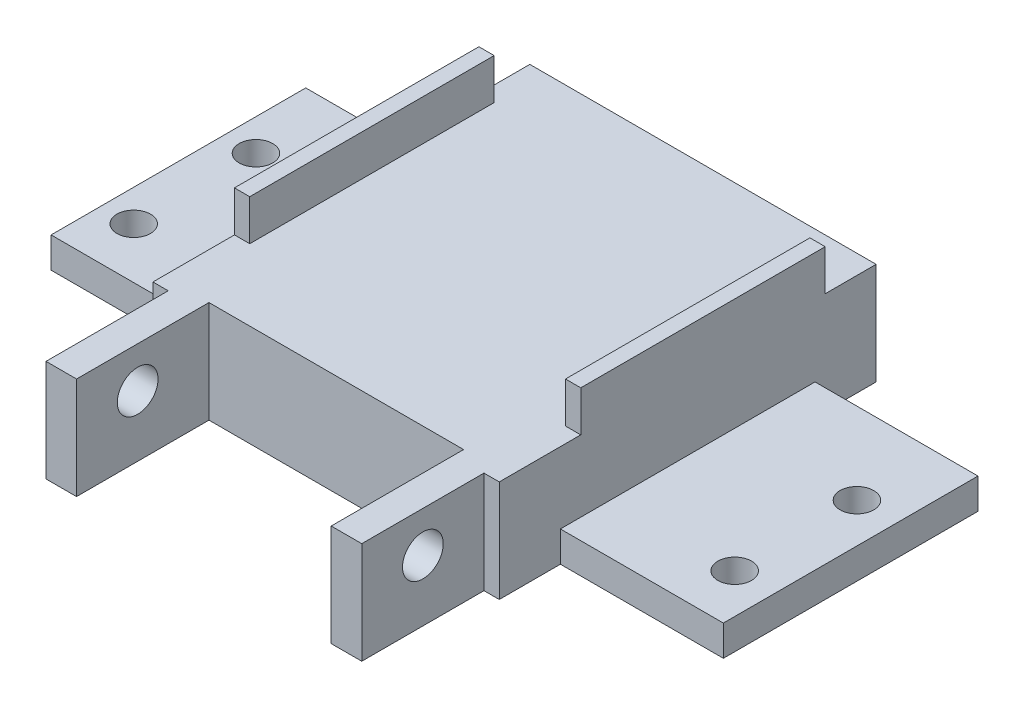
ISO-10303-21;
HEADER;
FILE_DESCRIPTION(('STEP AP214'),'2;1');
FILE_NAME('part.step','',(''),(''),'','','');
FILE_SCHEMA(('AUTOMOTIVE_DESIGN { 1 0 10303 214 1 1 1 1 }'));
ENDSEC;
DATA;
#1=APPLICATION_CONTEXT('core data for automotive mechanical design processes');
#2=APPLICATION_PROTOCOL_DEFINITION('international standard','automotive_design',2000,#1);
#3=PRODUCT_CONTEXT('',#1,'mechanical');
#4=PRODUCT('Part','Part','',(#3));
#5=PRODUCT_RELATED_PRODUCT_CATEGORY('part','',(#4));
#6=PRODUCT_DEFINITION_FORMATION('','',#4);
#7=PRODUCT_DEFINITION_CONTEXT('part definition',#1,'design');
#8=PRODUCT_DEFINITION('design','',#6,#7);
#9=PRODUCT_DEFINITION_SHAPE('','',#8);
#10=(LENGTH_UNIT() NAMED_UNIT(*) SI_UNIT(.MILLI.,.METRE.));
#11=(NAMED_UNIT(*) PLANE_ANGLE_UNIT() SI_UNIT($,.RADIAN.));
#12=(NAMED_UNIT(*) SI_UNIT($,.STERADIAN.) SOLID_ANGLE_UNIT());
#13=UNCERTAINTY_MEASURE_WITH_UNIT(LENGTH_MEASURE(1.E-05),#10,'distance_accuracy_value','');
#14=(GEOMETRIC_REPRESENTATION_CONTEXT(3) GLOBAL_UNCERTAINTY_ASSIGNED_CONTEXT((#13)) GLOBAL_UNIT_ASSIGNED_CONTEXT((#10,
#11,#12)) REPRESENTATION_CONTEXT('',''));
#15=CARTESIAN_POINT('',(0.,0.,0.));
#16=DIRECTION('',(0.,0.,1.));
#17=DIRECTION('',(1.,0.,0.));
#18=AXIS2_PLACEMENT_3D('',#15,#16,#17);
#19=CARTESIAN_POINT('',(-17.,10.,24.5));
#20=DIRECTION('',(1.,0.,0.));
#21=DIRECTION('',(0.,0.,-1.));
#22=AXIS2_PLACEMENT_3D('',#19,#20,#21);
#23=PLANE('',#22);
#24=DIRECTION('',(0.,-1.,0.));
#25=VECTOR('',#24,1.);
#26=CARTESIAN_POINT('',(-17.,3.,-18.5));
#27=LINE('',#26,#25);
#28=CARTESIAN_POINT('',(-17.,3.,-18.5));
#29=VERTEX_POINT('',#28);
#30=CARTESIAN_POINT('',(-17.,0.,-18.5));
#31=VERTEX_POINT('',#30);
#32=EDGE_CURVE('E244',#29,#31,#27,.T.);
#33=ORIENTED_EDGE('',*,*,#32,.F.);
#34=DIRECTION('',(0.,0.,1.));
#35=VECTOR('',#34,1.);
#36=CARTESIAN_POINT('',(-17.,3.,6.5));
#37=LINE('',#36,#35);
#38=CARTESIAN_POINT('',(-17.,3.,6.5));
#39=VERTEX_POINT('',#38);
#40=EDGE_CURVE('E237',#29,#39,#37,.T.);
#41=ORIENTED_EDGE('',*,*,#40,.T.);
#42=DIRECTION('',(0.,-1.,0.));
#43=VECTOR('',#42,1.);
#44=CARTESIAN_POINT('',(-17.,3.,6.5));
#45=LINE('',#44,#43);
#46=CARTESIAN_POINT('',(-17.,0.,6.5));
#47=VERTEX_POINT('',#46);
#48=EDGE_CURVE('E223',#39,#47,#45,.T.);
#49=ORIENTED_EDGE('',*,*,#48,.T.);
#50=DIRECTION('',(0.,0.,1.));
#51=VECTOR('',#50,1.);
#52=CARTESIAN_POINT('',(-17.,0.,24.5));
#53=LINE('',#52,#51);
#54=CARTESIAN_POINT('',(-17.,0.,12.5));
#55=VERTEX_POINT('',#54);
#56=EDGE_CURVE('E416',#47,#55,#53,.T.);
#57=ORIENTED_EDGE('',*,*,#56,.T.);
#58=DIRECTION('',(0.,1.,0.));
#59=VECTOR('',#58,1.);
#60=CARTESIAN_POINT('',(-17.,-28.1780056072107,12.5));
#61=LINE('',#60,#59);
#62=CARTESIAN_POINT('',(-17.,10.,12.5));
#63=VERTEX_POINT('',#62);
#64=EDGE_CURVE('E306',#55,#63,#61,.T.);
#65=ORIENTED_EDGE('',*,*,#64,.T.);
#66=DIRECTION('',(0.,0.,1.));
#67=VECTOR('',#66,1.);
#68=CARTESIAN_POINT('',(-17.,10.,24.5));
#69=LINE('',#68,#67);
#70=CARTESIAN_POINT('',(-17.,10.,4.5));
#71=VERTEX_POINT('',#70);
#72=EDGE_CURVE('E420',#71,#63,#69,.T.);
#73=ORIENTED_EDGE('',*,*,#72,.F.);
#74=DIRECTION('',(0.,-1.,0.));
#75=VECTOR('',#74,1.);
#76=CARTESIAN_POINT('',(-17.,14.,4.5));
#77=LINE('',#76,#75);
#78=CARTESIAN_POINT('',(-17.,14.,4.5));
#79=VERTEX_POINT('',#78);
#80=EDGE_CURVE('E413',#79,#71,#77,.T.);
#81=ORIENTED_EDGE('',*,*,#80,.F.);
#82=DIRECTION('',(0.,0.,1.));
#83=VECTOR('',#82,1.);
#84=CARTESIAN_POINT('',(-17.,14.,-19.5));
#85=LINE('',#84,#83);
#86=CARTESIAN_POINT('',(-17.,14.,-19.5));
#87=VERTEX_POINT('',#86);
#88=EDGE_CURVE('E387',#87,#79,#85,.T.);
#89=ORIENTED_EDGE('',*,*,#88,.F.);
#90=DIRECTION('',(0.,-1.,0.));
#91=VECTOR('',#90,1.);
#92=CARTESIAN_POINT('',(-17.,14.,-19.5));
#93=LINE('',#92,#91);
#94=CARTESIAN_POINT('',(-17.,10.,-19.5));
#95=VERTEX_POINT('',#94);
#96=EDGE_CURVE('E397',#87,#95,#93,.T.);
#97=ORIENTED_EDGE('',*,*,#96,.T.);
#98=CARTESIAN_POINT('',(-17.,10.,-24.5));
#99=VERTEX_POINT('',#98);
#100=EDGE_CURVE('E417',#99,#95,#69,.T.);
#101=ORIENTED_EDGE('',*,*,#100,.F.);
#102=DIRECTION('',(0.,-1.,0.));
#103=VECTOR('',#102,1.);
#104=CARTESIAN_POINT('',(-17.,10.,-24.5));
#105=LINE('',#104,#103);
#106=CARTESIAN_POINT('',(-17.,0.,-24.5));
#107=VERTEX_POINT('',#106);
#108=EDGE_CURVE('E47',#99,#107,#105,.T.);
#109=ORIENTED_EDGE('',*,*,#108,.T.);
#110=EDGE_CURVE('E429',#107,#31,#53,.T.);
#111=ORIENTED_EDGE('',*,*,#110,.T.);
#112=EDGE_LOOP('',(#33,#41,#49,#57,#65,#73,#81,#89,#97,#101,#109,#111));
#113=FACE_BOUND('',#112,.T.);
#114=ADVANCED_FACE('F39',(#113),#23,.F.);
#115=CARTESIAN_POINT('',(17.,10.,24.5));
#116=DIRECTION('',(-1.,0.,0.));
#117=DIRECTION('',(0.,0.,1.));
#118=AXIS2_PLACEMENT_3D('',#115,#116,#117);
#119=PLANE('',#118);
#120=DIRECTION('',(0.,-1.,0.));
#121=VECTOR('',#120,1.);
#122=CARTESIAN_POINT('',(17.,3.,6.5));
#123=LINE('',#122,#121);
#124=CARTESIAN_POINT('',(17.,3.,6.5));
#125=VERTEX_POINT('',#124);
#126=CARTESIAN_POINT('',(17.,0.,6.5));
#127=VERTEX_POINT('',#126);
#128=EDGE_CURVE('E283',#125,#127,#123,.T.);
#129=ORIENTED_EDGE('',*,*,#128,.F.);
#130=DIRECTION('',(0.,0.,-1.));
#131=VECTOR('',#130,1.);
#132=CARTESIAN_POINT('',(17.,3.,6.5));
#133=LINE('',#132,#131);
#134=CARTESIAN_POINT('',(17.,3.,-18.5));
#135=VERTEX_POINT('',#134);
#136=EDGE_CURVE('E263',#125,#135,#133,.T.);
#137=ORIENTED_EDGE('',*,*,#136,.T.);
#138=DIRECTION('',(0.,-1.,0.));
#139=VECTOR('',#138,1.);
#140=CARTESIAN_POINT('',(17.,3.,-18.5));
#141=LINE('',#140,#139);
#142=CARTESIAN_POINT('',(17.,0.,-18.5));
#143=VERTEX_POINT('',#142);
#144=EDGE_CURVE('E276',#135,#143,#141,.T.);
#145=ORIENTED_EDGE('',*,*,#144,.T.);
#146=DIRECTION('',(0.,0.,-1.));
#147=VECTOR('',#146,1.);
#148=CARTESIAN_POINT('',(17.,0.,24.5));
#149=LINE('',#148,#147);
#150=CARTESIAN_POINT('',(17.,0.,-24.5));
#151=VERTEX_POINT('',#150);
#152=EDGE_CURVE('E439',#143,#151,#149,.T.);
#153=ORIENTED_EDGE('',*,*,#152,.T.);
#154=DIRECTION('',(0.,-1.,0.));
#155=VECTOR('',#154,1.);
#156=CARTESIAN_POINT('',(17.,10.,-24.5));
#157=LINE('',#156,#155);
#158=CARTESIAN_POINT('',(17.,10.,-24.5));
#159=VERTEX_POINT('',#158);
#160=EDGE_CURVE('E11',#159,#151,#157,.T.);
#161=ORIENTED_EDGE('',*,*,#160,.F.);
#162=DIRECTION('',(0.,0.,-1.));
#163=VECTOR('',#162,1.);
#164=CARTESIAN_POINT('',(17.,10.,24.5));
#165=LINE('',#164,#163);
#166=CARTESIAN_POINT('',(17.,10.,-19.5));
#167=VERTEX_POINT('',#166);
#168=EDGE_CURVE('E427',#167,#159,#165,.T.);
#169=ORIENTED_EDGE('',*,*,#168,.F.);
#170=DIRECTION('',(0.,-1.,0.));
#171=VECTOR('',#170,1.);
#172=CARTESIAN_POINT('',(17.,14.,-19.5));
#173=LINE('',#172,#171);
#174=CARTESIAN_POINT('',(17.,14.,-19.5));
#175=VERTEX_POINT('',#174);
#176=EDGE_CURVE('E384',#175,#167,#173,.T.);
#177=ORIENTED_EDGE('',*,*,#176,.F.);
#178=DIRECTION('',(0.,0.,-1.));
#179=VECTOR('',#178,1.);
#180=CARTESIAN_POINT('',(17.,14.,-19.5));
#181=LINE('',#180,#179);
#182=CARTESIAN_POINT('',(17.,14.,4.5));
#183=VERTEX_POINT('',#182);
#184=EDGE_CURVE('E360',#183,#175,#181,.T.);
#185=ORIENTED_EDGE('',*,*,#184,.F.);
#186=DIRECTION('',(0.,-1.,0.));
#187=VECTOR('',#186,1.);
#188=CARTESIAN_POINT('',(17.,14.,4.5));
#189=LINE('',#188,#187);
#190=CARTESIAN_POINT('',(17.,10.,4.5));
#191=VERTEX_POINT('',#190);
#192=EDGE_CURVE('E370',#183,#191,#189,.T.);
#193=ORIENTED_EDGE('',*,*,#192,.T.);
#194=CARTESIAN_POINT('',(17.,10.,12.5));
#195=VERTEX_POINT('',#194);
#196=EDGE_CURVE('E424',#195,#191,#165,.T.);
#197=ORIENTED_EDGE('',*,*,#196,.F.);
#198=DIRECTION('',(0.,1.,0.));
#199=VECTOR('',#198,1.);
#200=CARTESIAN_POINT('',(17.,-28.1780056072107,12.5));
#201=LINE('',#200,#199);
#202=CARTESIAN_POINT('',(17.,0.,12.5));
#203=VERTEX_POINT('',#202);
#204=EDGE_CURVE('E332',#203,#195,#201,.T.);
#205=ORIENTED_EDGE('',*,*,#204,.F.);
#206=EDGE_CURVE('E435',#203,#127,#149,.T.);
#207=ORIENTED_EDGE('',*,*,#206,.T.);
#208=EDGE_LOOP('',(#129,#137,#145,#153,#161,#169,#177,#185,#193,#197,#205,#207));
#209=FACE_BOUND('',#208,.T.);
#210=ADVANCED_FACE('F472',(#209),#119,.F.);
#211=CARTESIAN_POINT('',(17.,10.,24.5));
#212=DIRECTION('',(0.,0.,-1.));
#213=DIRECTION('',(-1.,0.,0.));
#214=AXIS2_PLACEMENT_3D('',#211,#212,#213);
#215=PLANE('',#214);
#216=DIRECTION('',(1.,0.,0.));
#217=VECTOR('',#216,1.);
#218=CARTESIAN_POINT('',(17.,10.,24.5));
#219=LINE('',#218,#217);
#220=CARTESIAN_POINT('',(-15.5,10.,24.5));
#221=VERTEX_POINT('',#220);
#222=CARTESIAN_POINT('',(-12.5,10.,24.5));
#223=VERTEX_POINT('',#222);
#224=EDGE_CURVE('E423',#221,#223,#219,.T.);
#225=ORIENTED_EDGE('',*,*,#224,.F.);
#226=DIRECTION('',(0.,1.,0.));
#227=VECTOR('',#226,1.);
#228=CARTESIAN_POINT('',(-15.5,-28.1780056072107,24.5));
#229=LINE('',#228,#227);
#230=CARTESIAN_POINT('',(-15.5,0.,24.5));
#231=VERTEX_POINT('',#230);
#232=EDGE_CURVE('E316',#231,#221,#229,.T.);
#233=ORIENTED_EDGE('',*,*,#232,.F.);
#234=DIRECTION('',(1.,0.,0.));
#235=VECTOR('',#234,1.);
#236=CARTESIAN_POINT('',(17.,0.,24.5));
#237=LINE('',#236,#235);
#238=CARTESIAN_POINT('',(-12.5,0.,24.5));
#239=VERTEX_POINT('',#238);
#240=EDGE_CURVE('E434',#231,#239,#237,.T.);
#241=ORIENTED_EDGE('',*,*,#240,.T.);
#242=DIRECTION('',(0.,1.,0.));
#243=VECTOR('',#242,1.);
#244=CARTESIAN_POINT('',(-12.5,-28.1780056072107,24.5));
#245=LINE('',#244,#243);
#246=EDGE_CURVE('E351',#239,#223,#245,.T.);
#247=ORIENTED_EDGE('',*,*,#246,.T.);
#248=EDGE_LOOP('',(#225,#233,#241,#247));
#249=FACE_BOUND('',#248,.T.);
#250=ADVANCED_FACE('F476',(#249),#215,.F.);
#251=CARTESIAN_POINT('',(0.,10.,0.));
#252=DIRECTION('',(0.,1.,0.));
#253=DIRECTION('',(0.,0.,1.));
#254=AXIS2_PLACEMENT_3D('',#251,#252,#253);
#255=PLANE('',#254);
#256=DIRECTION('',(-1.,0.,0.));
#257=VECTOR('',#256,1.);
#258=CARTESIAN_POINT('',(-17.,10.,12.5));
#259=LINE('',#258,#257);
#260=CARTESIAN_POINT('',(-15.5,10.,12.5));
#261=VERTEX_POINT('',#260);
#262=EDGE_CURVE('E313',#261,#63,#259,.T.);
#263=ORIENTED_EDGE('',*,*,#262,.F.);
#264=DIRECTION('',(0.,0.,-1.));
#265=VECTOR('',#264,1.);
#266=CARTESIAN_POINT('',(-15.5,10.,24.5));
#267=LINE('',#266,#265);
#268=EDGE_CURVE('E310',#221,#261,#267,.T.);
#269=ORIENTED_EDGE('',*,*,#268,.F.);
#270=ORIENTED_EDGE('',*,*,#224,.T.);
#271=DIRECTION('',(0.,0.,1.));
#272=VECTOR('',#271,1.);
#273=CARTESIAN_POINT('',(-12.5,10.,24.5));
#274=LINE('',#273,#272);
#275=CARTESIAN_POINT('',(-12.5,10.,11.5));
#276=VERTEX_POINT('',#275);
#277=EDGE_CURVE('E302',#276,#223,#274,.T.);
#278=ORIENTED_EDGE('',*,*,#277,.F.);
#279=DIRECTION('',(-1.,0.,0.));
#280=VECTOR('',#279,1.);
#281=CARTESIAN_POINT('',(-12.5,10.,11.5));
#282=LINE('',#281,#280);
#283=CARTESIAN_POINT('',(12.5,10.,11.5));
#284=VERTEX_POINT('',#283);
#285=EDGE_CURVE('E349',#284,#276,#282,.T.);
#286=ORIENTED_EDGE('',*,*,#285,.F.);
#287=DIRECTION('',(0.,0.,-1.));
#288=VECTOR('',#287,1.);
#289=CARTESIAN_POINT('',(12.5,10.,24.5));
#290=LINE('',#289,#288);
#291=CARTESIAN_POINT('',(12.5,10.,24.5));
#292=VERTEX_POINT('',#291);
#293=EDGE_CURVE('E346',#292,#284,#290,.T.);
#294=ORIENTED_EDGE('',*,*,#293,.F.);
#295=CARTESIAN_POINT('',(15.5,10.,24.5));
#296=VERTEX_POINT('',#295);
#297=EDGE_CURVE('E419',#292,#296,#219,.T.);
#298=ORIENTED_EDGE('',*,*,#297,.T.);
#299=DIRECTION('',(0.,0.,1.));
#300=VECTOR('',#299,1.);
#301=CARTESIAN_POINT('',(15.5,10.,24.5));
#302=LINE('',#301,#300);
#303=CARTESIAN_POINT('',(15.5,10.,12.5));
#304=VERTEX_POINT('',#303);
#305=EDGE_CURVE('E329',#304,#296,#302,.T.);
#306=ORIENTED_EDGE('',*,*,#305,.F.);
#307=DIRECTION('',(-1.,0.,0.));
#308=VECTOR('',#307,1.);
#309=CARTESIAN_POINT('',(17.,10.,12.5));
#310=LINE('',#309,#308);
#311=EDGE_CURVE('E326',#195,#304,#310,.T.);
#312=ORIENTED_EDGE('',*,*,#311,.F.);
#313=ORIENTED_EDGE('',*,*,#196,.T.);
#314=DIRECTION('',(1.,0.,0.));
#315=VECTOR('',#314,1.);
#316=CARTESIAN_POINT('',(17.,10.,4.5));
#317=LINE('',#316,#315);
#318=CARTESIAN_POINT('',(15.5,10.,4.5));
#319=VERTEX_POINT('',#318);
#320=EDGE_CURVE('E364',#319,#191,#317,.T.);
#321=ORIENTED_EDGE('',*,*,#320,.F.);
#322=DIRECTION('',(0.,0.,1.));
#323=VECTOR('',#322,1.);
#324=CARTESIAN_POINT('',(15.5,10.,-19.5));
#325=LINE('',#324,#323);
#326=CARTESIAN_POINT('',(15.5,10.,-19.5));
#327=VERTEX_POINT('',#326);
#328=EDGE_CURVE('E372',#327,#319,#325,.T.);
#329=ORIENTED_EDGE('',*,*,#328,.F.);
#330=DIRECTION('',(-1.,0.,0.));
#331=VECTOR('',#330,1.);
#332=CARTESIAN_POINT('',(17.,10.,-19.5));
#333=LINE('',#332,#331);
#334=EDGE_CURVE('E309',#167,#327,#333,.T.);
#335=ORIENTED_EDGE('',*,*,#334,.F.);
#336=ORIENTED_EDGE('',*,*,#168,.T.);
#337=DIRECTION('',(-1.,0.,0.));
#338=VECTOR('',#337,1.);
#339=CARTESIAN_POINT('',(17.,10.,-24.5));
#340=LINE('',#339,#338);
#341=EDGE_CURVE('E426',#159,#99,#340,.T.);
#342=ORIENTED_EDGE('',*,*,#341,.T.);
#343=ORIENTED_EDGE('',*,*,#100,.T.);
#344=DIRECTION('',(-1.,0.,0.));
#345=VECTOR('',#344,1.);
#346=CARTESIAN_POINT('',(-17.,10.,-19.5));
#347=LINE('',#346,#345);
#348=CARTESIAN_POINT('',(-15.5,10.,-19.5));
#349=VERTEX_POINT('',#348);
#350=EDGE_CURVE('E391',#349,#95,#347,.T.);
#351=ORIENTED_EDGE('',*,*,#350,.F.);
#352=DIRECTION('',(0.,0.,-1.));
#353=VECTOR('',#352,1.);
#354=CARTESIAN_POINT('',(-15.5,10.,-19.5));
#355=LINE('',#354,#353);
#356=CARTESIAN_POINT('',(-15.5,10.,4.5));
#357=VERTEX_POINT('',#356);
#358=EDGE_CURVE('E400',#357,#349,#355,.T.);
#359=ORIENTED_EDGE('',*,*,#358,.F.);
#360=DIRECTION('',(1.,0.,0.));
#361=VECTOR('',#360,1.);
#362=CARTESIAN_POINT('',(-17.,10.,4.5));
#363=LINE('',#362,#361);
#364=EDGE_CURVE('E386',#71,#357,#363,.T.);
#365=ORIENTED_EDGE('',*,*,#364,.F.);
#366=ORIENTED_EDGE('',*,*,#72,.T.);
#367=EDGE_LOOP('',(#263,#269,#270,#278,#286,#294,#298,#306,#312,#313,#321,#329,#335,#336,#342,
#343,#351,#359,#365,#366));
#368=FACE_BOUND('',#367,.T.);
#369=ADVANCED_FACE('F482',(#368),#255,.T.);
#370=CARTESIAN_POINT('',(12.5,0.,24.5));
#371=VERTEX_POINT('',#370);
#372=CARTESIAN_POINT('',(15.5,0.,24.5));
#373=VERTEX_POINT('',#372);
#374=EDGE_CURVE('E431',#371,#373,#237,.T.);
#375=ORIENTED_EDGE('',*,*,#374,.T.);
#376=DIRECTION('',(0.,1.,0.));
#377=VECTOR('',#376,1.);
#378=CARTESIAN_POINT('',(15.5,-28.1780056072107,24.5));
#379=LINE('',#378,#377);
#380=EDGE_CURVE('E325',#373,#296,#379,.T.);
#381=ORIENTED_EDGE('',*,*,#380,.T.);
#382=ORIENTED_EDGE('',*,*,#297,.F.);
#383=DIRECTION('',(0.,1.,0.));
#384=VECTOR('',#383,1.);
#385=CARTESIAN_POINT('',(12.5,-28.1780056072107,24.5));
#386=LINE('',#385,#384);
#387=EDGE_CURVE('E356',#371,#292,#386,.T.);
#388=ORIENTED_EDGE('',*,*,#387,.F.);
#389=EDGE_LOOP('',(#375,#381,#382,#388));
#390=FACE_BOUND('',#389,.T.);
#391=ADVANCED_FACE('F484',(#390),#215,.F.);
#392=CARTESIAN_POINT('',(17.,10.,-24.5));
#393=DIRECTION('',(0.,0.,1.));
#394=DIRECTION('',(1.,0.,0.));
#395=AXIS2_PLACEMENT_3D('',#392,#393,#394);
#396=PLANE('',#395);
#397=DIRECTION('',(-1.,0.,0.));
#398=VECTOR('',#397,1.);
#399=CARTESIAN_POINT('',(17.,0.,-24.5));
#400=LINE('',#399,#398);
#401=EDGE_CURVE('E438',#151,#107,#400,.T.);
#402=ORIENTED_EDGE('',*,*,#401,.T.);
#403=ORIENTED_EDGE('',*,*,#108,.F.);
#404=ORIENTED_EDGE('',*,*,#341,.F.);
#405=ORIENTED_EDGE('',*,*,#160,.T.);
#406=EDGE_LOOP('',(#402,#403,#404,#405));
#407=FACE_BOUND('',#406,.T.);
#408=ADVANCED_FACE('F487',(#407),#396,.F.);
#409=CARTESIAN_POINT('',(0.,0.,0.));
#410=DIRECTION('',(0.,1.,0.));
#411=DIRECTION('',(0.,0.,1.));
#412=AXIS2_PLACEMENT_3D('',#409,#410,#411);
#413=PLANE('',#412);
#414=CARTESIAN_POINT('',(-29.8875948993684,0.,-10.5));
#415=DIRECTION('',(0.,-1.,0.));
#416=DIRECTION('',(0.,0.,-1.));
#417=AXIS2_PLACEMENT_3D('',#414,#415,#416);
#418=CIRCLE('',#417,1.65);
#419=CARTESIAN_POINT('',(-29.8875948993684,0.,-12.15));
#420=VERTEX_POINT('',#419);
#421=EDGE_CURVE('E648',#420,#420,#418,.T.);
#422=ORIENTED_EDGE('',*,*,#421,.F.);
#423=EDGE_LOOP('',(#422));
#424=FACE_BOUND('',#423,.T.);
#425=CARTESIAN_POINT('',(29.1124051006316,0.,1.50000000000001));
#426=DIRECTION('',(0.,-1.,0.));
#427=DIRECTION('',(0.,0.,-1.));
#428=AXIS2_PLACEMENT_3D('',#425,#426,#427);
#429=CIRCLE('',#428,1.65);
#430=CARTESIAN_POINT('',(29.1124051006316,0.,-0.149999999999994));
#431=VERTEX_POINT('',#430);
#432=EDGE_CURVE('E651',#431,#431,#429,.T.);
#433=ORIENTED_EDGE('',*,*,#432,.F.);
#434=EDGE_LOOP('',(#433));
#435=FACE_BOUND('',#434,.T.);
#436=CARTESIAN_POINT('',(-29.8875948993684,0.,1.5));
#437=DIRECTION('',(0.,-1.,0.));
#438=DIRECTION('',(0.,0.,-1.));
#439=AXIS2_PLACEMENT_3D('',#436,#437,#438);
#440=CIRCLE('',#439,1.65);
#441=CARTESIAN_POINT('',(-29.8875948993684,0.,-0.150000000000001));
#442=VERTEX_POINT('',#441);
#443=EDGE_CURVE('E655',#442,#442,#440,.T.);
#444=ORIENTED_EDGE('',*,*,#443,.F.);
#445=EDGE_LOOP('',(#444));
#446=FACE_BOUND('',#445,.T.);
#447=CARTESIAN_POINT('',(29.1124051006316,0.,-10.5));
#448=DIRECTION('',(0.,-1.,0.));
#449=DIRECTION('',(0.,0.,-1.));
#450=AXIS2_PLACEMENT_3D('',#447,#448,#449);
#451=CIRCLE('',#450,1.65);
#452=CARTESIAN_POINT('',(29.1124051006316,0.,-12.15));
#453=VERTEX_POINT('',#452);
#454=EDGE_CURVE('E251',#453,#453,#451,.T.);
#455=ORIENTED_EDGE('',*,*,#454,.F.);
#456=EDGE_LOOP('',(#455));
#457=FACE_BOUND('',#456,.T.);
#458=DIRECTION('',(0.,0.,1.));
#459=VECTOR('',#458,1.);
#460=CARTESIAN_POINT('',(12.5,0.,24.5));
#461=LINE('',#460,#459);
#462=CARTESIAN_POINT('',(12.5,0.,11.5));
#463=VERTEX_POINT('',#462);
#464=EDGE_CURVE('E339',#463,#371,#461,.T.);
#465=ORIENTED_EDGE('',*,*,#464,.F.);
#466=DIRECTION('',(1.,0.,0.));
#467=VECTOR('',#466,1.);
#468=CARTESIAN_POINT('',(-12.5,0.,11.5));
#469=LINE('',#468,#467);
#470=CARTESIAN_POINT('',(-12.5,0.,11.5));
#471=VERTEX_POINT('',#470);
#472=EDGE_CURVE('E341',#471,#463,#469,.T.);
#473=ORIENTED_EDGE('',*,*,#472,.F.);
#474=DIRECTION('',(0.,0.,-1.));
#475=VECTOR('',#474,1.);
#476=CARTESIAN_POINT('',(-12.5,0.,24.5));
#477=LINE('',#476,#475);
#478=EDGE_CURVE('E330',#239,#471,#477,.T.);
#479=ORIENTED_EDGE('',*,*,#478,.F.);
#480=ORIENTED_EDGE('',*,*,#240,.F.);
#481=DIRECTION('',(0.,0.,1.));
#482=VECTOR('',#481,1.);
#483=CARTESIAN_POINT('',(-15.5,0.,24.5));
#484=LINE('',#483,#482);
#485=CARTESIAN_POINT('',(-15.5,0.,12.5));
#486=VERTEX_POINT('',#485);
#487=EDGE_CURVE('E303',#486,#231,#484,.T.);
#488=ORIENTED_EDGE('',*,*,#487,.F.);
#489=DIRECTION('',(1.,0.,0.));
#490=VECTOR('',#489,1.);
#491=CARTESIAN_POINT('',(-17.,0.,12.5));
#492=LINE('',#491,#490);
#493=EDGE_CURVE('E305',#55,#486,#492,.T.);
#494=ORIENTED_EDGE('',*,*,#493,.F.);
#495=ORIENTED_EDGE('',*,*,#56,.F.);
#496=DIRECTION('',(-1.,0.,0.));
#497=VECTOR('',#496,1.);
#498=CARTESIAN_POINT('',(-17.,0.,6.5));
#499=LINE('',#498,#497);
#500=CARTESIAN_POINT('',(-33.,0.,6.49999999999999));
#501=VERTEX_POINT('',#500);
#502=EDGE_CURVE('E55',#47,#501,#499,.T.);
#503=ORIENTED_EDGE('',*,*,#502,.T.);
#504=DIRECTION('',(0.,0.,-1.));
#505=VECTOR('',#504,1.);
#506=CARTESIAN_POINT('',(-33.,0.,6.49999999999999));
#507=LINE('',#506,#505);
#508=CARTESIAN_POINT('',(-33.,0.,-18.5));
#509=VERTEX_POINT('',#508);
#510=EDGE_CURVE('E248',#501,#509,#507,.T.);
#511=ORIENTED_EDGE('',*,*,#510,.T.);
#512=DIRECTION('',(1.,0.,0.));
#513=VECTOR('',#512,1.);
#514=CARTESIAN_POINT('',(-17.,0.,-18.5));
#515=LINE('',#514,#513);
#516=EDGE_CURVE('E245',#509,#31,#515,.T.);
#517=ORIENTED_EDGE('',*,*,#516,.T.);
#518=ORIENTED_EDGE('',*,*,#110,.F.);
#519=ORIENTED_EDGE('',*,*,#401,.F.);
#520=ORIENTED_EDGE('',*,*,#152,.F.);
#521=DIRECTION('',(1.,0.,0.));
#522=VECTOR('',#521,1.);
#523=CARTESIAN_POINT('',(17.,0.,-18.5));
#524=LINE('',#523,#522);
#525=CARTESIAN_POINT('',(33.,0.,-18.5));
#526=VERTEX_POINT('',#525);
#527=EDGE_CURVE('E63',#143,#526,#524,.T.);
#528=ORIENTED_EDGE('',*,*,#527,.T.);
#529=DIRECTION('',(0.,0.,1.));
#530=VECTOR('',#529,1.);
#531=CARTESIAN_POINT('',(33.,0.,6.5));
#532=LINE('',#531,#530);
#533=CARTESIAN_POINT('',(33.,0.,6.5));
#534=VERTEX_POINT('',#533);
#535=EDGE_CURVE('E278',#526,#534,#532,.T.);
#536=ORIENTED_EDGE('',*,*,#535,.T.);
#537=DIRECTION('',(-1.,0.,0.));
#538=VECTOR('',#537,1.);
#539=CARTESIAN_POINT('',(17.,0.,6.5));
#540=LINE('',#539,#538);
#541=EDGE_CURVE('E267',#534,#127,#540,.T.);
#542=ORIENTED_EDGE('',*,*,#541,.T.);
#543=ORIENTED_EDGE('',*,*,#206,.F.);
#544=DIRECTION('',(1.,0.,0.));
#545=VECTOR('',#544,1.);
#546=CARTESIAN_POINT('',(17.,0.,12.5));
#547=LINE('',#546,#545);
#548=CARTESIAN_POINT('',(15.5,0.,12.5));
#549=VERTEX_POINT('',#548);
#550=EDGE_CURVE('E314',#549,#203,#547,.T.);
#551=ORIENTED_EDGE('',*,*,#550,.F.);
#552=DIRECTION('',(0.,0.,-1.));
#553=VECTOR('',#552,1.);
#554=CARTESIAN_POINT('',(15.5,0.,24.5));
#555=LINE('',#554,#553);
#556=EDGE_CURVE('E322',#373,#549,#555,.T.);
#557=ORIENTED_EDGE('',*,*,#556,.F.);
#558=ORIENTED_EDGE('',*,*,#374,.F.);
#559=EDGE_LOOP('',(#465,#473,#479,#480,#488,#494,#495,#503,#511,#517,#518,#519,#520,#528,#536,
#542,#543,#551,#557,#558));
#560=FACE_BOUND('',#559,.T.);
#561=ADVANCED_FACE('F495',(#424,#435,#446,#457,#560),#413,.F.);
#562=CARTESIAN_POINT('',(-17.,14.,4.5));
#563=DIRECTION('',(0.,0.,-1.));
#564=DIRECTION('',(-1.,0.,0.));
#565=AXIS2_PLACEMENT_3D('',#562,#563,#564);
#566=PLANE('',#565);
#567=ORIENTED_EDGE('',*,*,#364,.T.);
#568=DIRECTION('',(0.,-1.,0.));
#569=VECTOR('',#568,1.);
#570=CARTESIAN_POINT('',(-15.5,14.,4.5));
#571=LINE('',#570,#569);
#572=CARTESIAN_POINT('',(-15.5,14.,4.5));
#573=VERTEX_POINT('',#572);
#574=EDGE_CURVE('E410',#573,#357,#571,.T.);
#575=ORIENTED_EDGE('',*,*,#574,.F.);
#576=DIRECTION('',(1.,0.,0.));
#577=VECTOR('',#576,1.);
#578=CARTESIAN_POINT('',(-17.,14.,4.5));
#579=LINE('',#578,#577);
#580=EDGE_CURVE('E390',#79,#573,#579,.T.);
#581=ORIENTED_EDGE('',*,*,#580,.F.);
#582=ORIENTED_EDGE('',*,*,#80,.T.);
#583=EDGE_LOOP('',(#567,#575,#581,#582));
#584=FACE_BOUND('',#583,.T.);
#585=ADVANCED_FACE('F553',(#584),#566,.F.);
#586=CARTESIAN_POINT('',(-15.5,14.,-19.5));
#587=DIRECTION('',(-1.,0.,0.));
#588=DIRECTION('',(0.,0.,1.));
#589=AXIS2_PLACEMENT_3D('',#586,#587,#588);
#590=PLANE('',#589);
#591=ORIENTED_EDGE('',*,*,#358,.T.);
#592=DIRECTION('',(0.,-1.,0.));
#593=VECTOR('',#592,1.);
#594=CARTESIAN_POINT('',(-15.5,14.,-19.5));
#595=LINE('',#594,#593);
#596=CARTESIAN_POINT('',(-15.5,14.,-19.5));
#597=VERTEX_POINT('',#596);
#598=EDGE_CURVE('E407',#597,#349,#595,.T.);
#599=ORIENTED_EDGE('',*,*,#598,.F.);
#600=DIRECTION('',(0.,0.,-1.));
#601=VECTOR('',#600,1.);
#602=CARTESIAN_POINT('',(-15.5,14.,-19.5));
#603=LINE('',#602,#601);
#604=EDGE_CURVE('E393',#573,#597,#603,.T.);
#605=ORIENTED_EDGE('',*,*,#604,.F.);
#606=ORIENTED_EDGE('',*,*,#574,.T.);
#607=EDGE_LOOP('',(#591,#599,#605,#606));
#608=FACE_BOUND('',#607,.T.);
#609=ADVANCED_FACE('F548',(#608),#590,.F.);
#610=CARTESIAN_POINT('',(-17.,14.,-19.5));
#611=DIRECTION('',(0.,0.,1.));
#612=DIRECTION('',(1.,0.,0.));
#613=AXIS2_PLACEMENT_3D('',#610,#611,#612);
#614=PLANE('',#613);
#615=ORIENTED_EDGE('',*,*,#350,.T.);
#616=ORIENTED_EDGE('',*,*,#96,.F.);
#617=DIRECTION('',(-1.,0.,0.));
#618=VECTOR('',#617,1.);
#619=CARTESIAN_POINT('',(-17.,14.,-19.5));
#620=LINE('',#619,#618);
#621=EDGE_CURVE('E395',#597,#87,#620,.T.);
#622=ORIENTED_EDGE('',*,*,#621,.F.);
#623=ORIENTED_EDGE('',*,*,#598,.T.);
#624=EDGE_LOOP('',(#615,#616,#622,#623));
#625=FACE_BOUND('',#624,.T.);
#626=ADVANCED_FACE('F543',(#625),#614,.F.);
#627=CARTESIAN_POINT('',(0.,14.,0.));
#628=DIRECTION('',(0.,1.,0.));
#629=DIRECTION('',(0.,0.,1.));
#630=AXIS2_PLACEMENT_3D('',#627,#628,#629);
#631=PLANE('',#630);
#632=ORIENTED_EDGE('',*,*,#88,.T.);
#633=ORIENTED_EDGE('',*,*,#580,.T.);
#634=ORIENTED_EDGE('',*,*,#604,.T.);
#635=ORIENTED_EDGE('',*,*,#621,.T.);
#636=EDGE_LOOP('',(#632,#633,#634,#635));
#637=FACE_BOUND('',#636,.T.);
#638=ADVANCED_FACE('F631',(#637),#631,.T.);
#639=CARTESIAN_POINT('',(17.,14.,-19.5));
#640=DIRECTION('',(0.,0.,1.));
#641=DIRECTION('',(1.,0.,0.));
#642=AXIS2_PLACEMENT_3D('',#639,#640,#641);
#643=PLANE('',#642);
#644=ORIENTED_EDGE('',*,*,#334,.T.);
#645=DIRECTION('',(0.,-1.,0.));
#646=VECTOR('',#645,1.);
#647=CARTESIAN_POINT('',(15.5,14.,-19.5));
#648=LINE('',#647,#646);
#649=CARTESIAN_POINT('',(15.5,14.,-19.5));
#650=VERTEX_POINT('',#649);
#651=EDGE_CURVE('E381',#650,#327,#648,.T.);
#652=ORIENTED_EDGE('',*,*,#651,.F.);
#653=DIRECTION('',(-1.,0.,0.));
#654=VECTOR('',#653,1.);
#655=CARTESIAN_POINT('',(17.,14.,-19.5));
#656=LINE('',#655,#654);
#657=EDGE_CURVE('E363',#175,#650,#656,.T.);
#658=ORIENTED_EDGE('',*,*,#657,.F.);
#659=ORIENTED_EDGE('',*,*,#176,.T.);
#660=EDGE_LOOP('',(#644,#652,#658,#659));
#661=FACE_BOUND('',#660,.T.);
#662=ADVANCED_FACE('F627',(#661),#643,.F.);
#663=CARTESIAN_POINT('',(15.5,14.,-19.5));
#664=DIRECTION('',(1.,0.,0.));
#665=DIRECTION('',(0.,0.,-1.));
#666=AXIS2_PLACEMENT_3D('',#663,#664,#665);
#667=PLANE('',#666);
#668=ORIENTED_EDGE('',*,*,#328,.T.);
#669=DIRECTION('',(0.,-1.,0.));
#670=VECTOR('',#669,1.);
#671=CARTESIAN_POINT('',(15.5,14.,4.5));
#672=LINE('',#671,#670);
#673=CARTESIAN_POINT('',(15.5,14.,4.5));
#674=VERTEX_POINT('',#673);
#675=EDGE_CURVE('E379',#674,#319,#672,.T.);
#676=ORIENTED_EDGE('',*,*,#675,.F.);
#677=DIRECTION('',(0.,0.,1.));
#678=VECTOR('',#677,1.);
#679=CARTESIAN_POINT('',(15.5,14.,-19.5));
#680=LINE('',#679,#678);
#681=EDGE_CURVE('E366',#650,#674,#680,.T.);
#682=ORIENTED_EDGE('',*,*,#681,.F.);
#683=ORIENTED_EDGE('',*,*,#651,.T.);
#684=EDGE_LOOP('',(#668,#676,#682,#683));
#685=FACE_BOUND('',#684,.T.);
#686=ADVANCED_FACE('F623',(#685),#667,.F.);
#687=CARTESIAN_POINT('',(17.,14.,4.5));
#688=DIRECTION('',(0.,0.,-1.));
#689=DIRECTION('',(-1.,0.,0.));
#690=AXIS2_PLACEMENT_3D('',#687,#688,#689);
#691=PLANE('',#690);
#692=ORIENTED_EDGE('',*,*,#320,.T.);
#693=ORIENTED_EDGE('',*,*,#192,.F.);
#694=DIRECTION('',(1.,0.,0.));
#695=VECTOR('',#694,1.);
#696=CARTESIAN_POINT('',(17.,14.,4.5));
#697=LINE('',#696,#695);
#698=EDGE_CURVE('E368',#674,#183,#697,.T.);
#699=ORIENTED_EDGE('',*,*,#698,.F.);
#700=ORIENTED_EDGE('',*,*,#675,.T.);
#701=EDGE_LOOP('',(#692,#693,#699,#700));
#702=FACE_BOUND('',#701,.T.);
#703=ADVANCED_FACE('F619',(#702),#691,.F.);
#704=CARTESIAN_POINT('',(0.,14.,0.));
#705=DIRECTION('',(0.,-1.,0.));
#706=DIRECTION('',(0.,0.,-1.));
#707=AXIS2_PLACEMENT_3D('',#704,#705,#706);
#708=PLANE('',#707);
#709=ORIENTED_EDGE('',*,*,#184,.T.);
#710=ORIENTED_EDGE('',*,*,#657,.T.);
#711=ORIENTED_EDGE('',*,*,#681,.T.);
#712=ORIENTED_EDGE('',*,*,#698,.T.);
#713=EDGE_LOOP('',(#709,#710,#711,#712));
#714=FACE_BOUND('',#713,.T.);
#715=ADVANCED_FACE('F615',(#714),#708,.F.);
#716=CARTESIAN_POINT('',(-12.5,-28.1780056072107,24.5));
#717=DIRECTION('',(-1.,0.,0.));
#718=DIRECTION('',(0.,0.,1.));
#719=AXIS2_PLACEMENT_3D('',#716,#717,#718);
#720=PLANE('',#719);
#721=CARTESIAN_POINT('',(-12.5,6.,18.5));
#722=DIRECTION('',(-1.,0.,0.));
#723=DIRECTION('',(0.,0.,1.));
#724=AXIS2_PLACEMENT_3D('',#721,#722,#723);
#725=CIRCLE('',#724,2.);
#726=CARTESIAN_POINT('',(-12.5,6.,20.5));
#727=VERTEX_POINT('',#726);
#728=EDGE_CURVE('E299',#727,#727,#725,.T.);
#729=ORIENTED_EDGE('',*,*,#728,.T.);
#730=EDGE_LOOP('',(#729));
#731=FACE_BOUND('',#730,.T.);
#732=ORIENTED_EDGE('',*,*,#478,.T.);
#733=DIRECTION('',(0.,1.,0.));
#734=VECTOR('',#733,1.);
#735=CARTESIAN_POINT('',(-12.5,-28.1780056072107,11.5));
#736=LINE('',#735,#734);
#737=EDGE_CURVE('E342',#471,#276,#736,.T.);
#738=ORIENTED_EDGE('',*,*,#737,.T.);
#739=ORIENTED_EDGE('',*,*,#277,.T.);
#740=ORIENTED_EDGE('',*,*,#246,.F.);
#741=EDGE_LOOP('',(#732,#738,#739,#740));
#742=FACE_BOUND('',#741,.T.);
#743=ADVANCED_FACE('F609',(#731,#742),#720,.F.);
#744=CARTESIAN_POINT('',(-12.5,-28.1780056072107,11.5));
#745=DIRECTION('',(0.,0.,-1.));
#746=DIRECTION('',(-1.,0.,0.));
#747=AXIS2_PLACEMENT_3D('',#744,#745,#746);
#748=PLANE('',#747);
#749=ORIENTED_EDGE('',*,*,#285,.T.);
#750=ORIENTED_EDGE('',*,*,#737,.F.);
#751=ORIENTED_EDGE('',*,*,#472,.T.);
#752=DIRECTION('',(0.,1.,0.));
#753=VECTOR('',#752,1.);
#754=CARTESIAN_POINT('',(12.5,-28.1780056072107,11.5));
#755=LINE('',#754,#753);
#756=EDGE_CURVE('E354',#463,#284,#755,.T.);
#757=ORIENTED_EDGE('',*,*,#756,.T.);
#758=EDGE_LOOP('',(#749,#750,#751,#757));
#759=FACE_BOUND('',#758,.T.);
#760=ADVANCED_FACE('F521',(#759),#748,.F.);
#761=CARTESIAN_POINT('',(12.5,-28.1780056072107,24.5));
#762=DIRECTION('',(1.,0.,0.));
#763=DIRECTION('',(0.,0.,-1.));
#764=AXIS2_PLACEMENT_3D('',#761,#762,#763);
#765=PLANE('',#764);
#766=CARTESIAN_POINT('',(12.5,6.,18.5));
#767=DIRECTION('',(1.,0.,0.));
#768=DIRECTION('',(0.,0.,-1.));
#769=AXIS2_PLACEMENT_3D('',#766,#767,#768);
#770=CIRCLE('',#769,2.);
#771=CARTESIAN_POINT('',(12.5,6.,16.5));
#772=VERTEX_POINT('',#771);
#773=EDGE_CURVE('E296',#772,#772,#770,.T.);
#774=ORIENTED_EDGE('',*,*,#773,.T.);
#775=EDGE_LOOP('',(#774));
#776=FACE_BOUND('',#775,.T.);
#777=ORIENTED_EDGE('',*,*,#464,.T.);
#778=ORIENTED_EDGE('',*,*,#387,.T.);
#779=ORIENTED_EDGE('',*,*,#293,.T.);
#780=ORIENTED_EDGE('',*,*,#756,.F.);
#781=EDGE_LOOP('',(#777,#778,#779,#780));
#782=FACE_BOUND('',#781,.T.);
#783=ADVANCED_FACE('F519',(#776,#782),#765,.F.);
#784=CARTESIAN_POINT('',(15.5,-28.1780056072107,24.5));
#785=DIRECTION('',(-1.,0.,0.));
#786=DIRECTION('',(0.,0.,1.));
#787=AXIS2_PLACEMENT_3D('',#784,#785,#786);
#788=PLANE('',#787);
#789=CARTESIAN_POINT('',(15.5,6.,18.5));
#790=DIRECTION('',(-1.,0.,0.));
#791=DIRECTION('',(0.,0.,1.));
#792=AXIS2_PLACEMENT_3D('',#789,#790,#791);
#793=CIRCLE('',#792,2.);
#794=CARTESIAN_POINT('',(15.5,6.,20.5));
#795=VERTEX_POINT('',#794);
#796=EDGE_CURVE('E293',#795,#795,#793,.F.);
#797=ORIENTED_EDGE('',*,*,#796,.F.);
#798=EDGE_LOOP('',(#797));
#799=FACE_BOUND('',#798,.T.);
#800=ORIENTED_EDGE('',*,*,#556,.T.);
#801=DIRECTION('',(0.,1.,0.));
#802=VECTOR('',#801,1.);
#803=CARTESIAN_POINT('',(15.5,-28.1780056072107,12.5));
#804=LINE('',#803,#802);
#805=EDGE_CURVE('E335',#549,#304,#804,.T.);
#806=ORIENTED_EDGE('',*,*,#805,.T.);
#807=ORIENTED_EDGE('',*,*,#305,.T.);
#808=ORIENTED_EDGE('',*,*,#380,.F.);
#809=EDGE_LOOP('',(#800,#806,#807,#808));
#810=FACE_BOUND('',#809,.T.);
#811=ADVANCED_FACE('F509',(#799,#810),#788,.F.);
#812=CARTESIAN_POINT('',(17.,-28.1780056072107,12.5));
#813=DIRECTION('',(0.,0.,-1.));
#814=DIRECTION('',(-1.,0.,0.));
#815=AXIS2_PLACEMENT_3D('',#812,#813,#814);
#816=PLANE('',#815);
#817=ORIENTED_EDGE('',*,*,#550,.T.);
#818=ORIENTED_EDGE('',*,*,#204,.T.);
#819=ORIENTED_EDGE('',*,*,#311,.T.);
#820=ORIENTED_EDGE('',*,*,#805,.F.);
#821=EDGE_LOOP('',(#817,#818,#819,#820));
#822=FACE_BOUND('',#821,.T.);
#823=ADVANCED_FACE('F597',(#822),#816,.F.);
#824=CARTESIAN_POINT('',(-17.,-28.1780056072107,12.5));
#825=DIRECTION('',(0.,0.,-1.));
#826=DIRECTION('',(-1.,0.,0.));
#827=AXIS2_PLACEMENT_3D('',#824,#825,#826);
#828=PLANE('',#827);
#829=ORIENTED_EDGE('',*,*,#493,.T.);
#830=DIRECTION('',(0.,1.,0.));
#831=VECTOR('',#830,1.);
#832=CARTESIAN_POINT('',(-15.5,-28.1780056072107,12.5));
#833=LINE('',#832,#831);
#834=EDGE_CURVE('E319',#486,#261,#833,.T.);
#835=ORIENTED_EDGE('',*,*,#834,.T.);
#836=ORIENTED_EDGE('',*,*,#262,.T.);
#837=ORIENTED_EDGE('',*,*,#64,.F.);
#838=EDGE_LOOP('',(#829,#835,#836,#837));
#839=FACE_BOUND('',#838,.T.);
#840=ADVANCED_FACE('F558',(#839),#828,.F.);
#841=CARTESIAN_POINT('',(-15.5,-28.1780056072107,24.5));
#842=DIRECTION('',(1.,0.,0.));
#843=DIRECTION('',(0.,0.,-1.));
#844=AXIS2_PLACEMENT_3D('',#841,#842,#843);
#845=PLANE('',#844);
#846=CARTESIAN_POINT('',(-15.5,6.,18.5));
#847=DIRECTION('',(-1.,0.,0.));
#848=DIRECTION('',(0.,0.,1.));
#849=AXIS2_PLACEMENT_3D('',#846,#847,#848);
#850=CIRCLE('',#849,2.);
#851=CARTESIAN_POINT('',(-15.5,6.,20.5));
#852=VERTEX_POINT('',#851);
#853=EDGE_CURVE('E285',#852,#852,#850,.T.);
#854=ORIENTED_EDGE('',*,*,#853,.F.);
#855=EDGE_LOOP('',(#854));
#856=FACE_BOUND('',#855,.T.);
#857=ORIENTED_EDGE('',*,*,#487,.T.);
#858=ORIENTED_EDGE('',*,*,#232,.T.);
#859=ORIENTED_EDGE('',*,*,#268,.T.);
#860=ORIENTED_EDGE('',*,*,#834,.F.);
#861=EDGE_LOOP('',(#857,#858,#859,#860));
#862=FACE_BOUND('',#861,.T.);
#863=ADVANCED_FACE('F561',(#856,#862),#845,.F.);
#864=CARTESIAN_POINT('',(21.1568542494924,6.,18.5));
#865=DIRECTION('',(-1.,0.,0.));
#866=DIRECTION('',(0.,0.,1.));
#867=AXIS2_PLACEMENT_3D('',#864,#865,#866);
#868=CYLINDRICAL_SURFACE('',#867,2.);
#869=ORIENTED_EDGE('',*,*,#853,.T.);
#870=EDGE_LOOP('',(#869));
#871=FACE_BOUND('',#870,.T.);
#872=ORIENTED_EDGE('',*,*,#728,.F.);
#873=EDGE_LOOP('',(#872));
#874=FACE_BOUND('',#873,.T.);
#875=ADVANCED_FACE('F591',(#871,#874),#868,.F.);
#876=ORIENTED_EDGE('',*,*,#796,.T.);
#877=EDGE_LOOP('',(#876));
#878=FACE_BOUND('',#877,.T.);
#879=ORIENTED_EDGE('',*,*,#773,.F.);
#880=EDGE_LOOP('',(#879));
#881=FACE_BOUND('',#880,.T.);
#882=ADVANCED_FACE('F584',(#878,#881),#868,.F.);
#883=CARTESIAN_POINT('',(17.,3.,6.5));
#884=DIRECTION('',(0.,0.,1.));
#885=DIRECTION('',(1.,0.,0.));
#886=AXIS2_PLACEMENT_3D('',#883,#884,#885);
#887=PLANE('',#886);
#888=ORIENTED_EDGE('',*,*,#541,.F.);
#889=DIRECTION('',(0.,-1.,0.));
#890=VECTOR('',#889,1.);
#891=CARTESIAN_POINT('',(33.,3.,6.5));
#892=LINE('',#891,#890);
#893=CARTESIAN_POINT('',(33.,3.,6.5));
#894=VERTEX_POINT('',#893);
#895=EDGE_CURVE('E286',#894,#534,#892,.T.);
#896=ORIENTED_EDGE('',*,*,#895,.F.);
#897=DIRECTION('',(-1.,0.,0.));
#898=VECTOR('',#897,1.);
#899=CARTESIAN_POINT('',(17.,3.,6.5));
#900=LINE('',#899,#898);
#901=EDGE_CURVE('E273',#894,#125,#900,.T.);
#902=ORIENTED_EDGE('',*,*,#901,.T.);
#903=ORIENTED_EDGE('',*,*,#128,.T.);
#904=EDGE_LOOP('',(#888,#896,#902,#903));
#905=FACE_BOUND('',#904,.T.);
#906=ADVANCED_FACE('F580',(#905),#887,.T.);
#907=CARTESIAN_POINT('',(33.,3.,6.5));
#908=DIRECTION('',(1.,0.,0.));
#909=DIRECTION('',(0.,0.,-1.));
#910=AXIS2_PLACEMENT_3D('',#907,#908,#909);
#911=PLANE('',#910);
#912=ORIENTED_EDGE('',*,*,#535,.F.);
#913=DIRECTION('',(0.,-1.,0.));
#914=VECTOR('',#913,1.);
#915=CARTESIAN_POINT('',(33.,3.,-18.5));
#916=LINE('',#915,#914);
#917=CARTESIAN_POINT('',(33.,3.,-18.5));
#918=VERTEX_POINT('',#917);
#919=EDGE_CURVE('E288',#918,#526,#916,.T.);
#920=ORIENTED_EDGE('',*,*,#919,.F.);
#921=DIRECTION('',(0.,0.,1.));
#922=VECTOR('',#921,1.);
#923=CARTESIAN_POINT('',(33.,3.,6.5));
#924=LINE('',#923,#922);
#925=EDGE_CURVE('E270',#918,#894,#924,.T.);
#926=ORIENTED_EDGE('',*,*,#925,.T.);
#927=ORIENTED_EDGE('',*,*,#895,.T.);
#928=EDGE_LOOP('',(#912,#920,#926,#927));
#929=FACE_BOUND('',#928,.T.);
#930=ADVANCED_FACE('F583',(#929),#911,.T.);
#931=CARTESIAN_POINT('',(17.,3.,-18.5));
#932=DIRECTION('',(0.,0.,-1.));
#933=DIRECTION('',(-1.,0.,0.));
#934=AXIS2_PLACEMENT_3D('',#931,#932,#933);
#935=PLANE('',#934);
#936=ORIENTED_EDGE('',*,*,#527,.F.);
#937=ORIENTED_EDGE('',*,*,#144,.F.);
#938=DIRECTION('',(1.,0.,0.));
#939=VECTOR('',#938,1.);
#940=CARTESIAN_POINT('',(17.,3.,-18.5));
#941=LINE('',#940,#939);
#942=EDGE_CURVE('E266',#135,#918,#941,.T.);
#943=ORIENTED_EDGE('',*,*,#942,.T.);
#944=ORIENTED_EDGE('',*,*,#919,.T.);
#945=EDGE_LOOP('',(#936,#937,#943,#944));
#946=FACE_BOUND('',#945,.T.);
#947=ADVANCED_FACE('F579',(#946),#935,.T.);
#948=CARTESIAN_POINT('',(0.,3.,0.));
#949=DIRECTION('',(0.,-1.,0.));
#950=DIRECTION('',(0.,0.,-1.));
#951=AXIS2_PLACEMENT_3D('',#948,#949,#950);
#952=PLANE('',#951);
#953=CARTESIAN_POINT('',(29.1124051006316,3.,1.50000000000001));
#954=DIRECTION('',(0.,-1.,0.));
#955=DIRECTION('',(0.,0.,-1.));
#956=AXIS2_PLACEMENT_3D('',#953,#954,#955);
#957=CIRCLE('',#956,1.65);
#958=CARTESIAN_POINT('',(29.1124051006316,3.,-0.149999999999994));
#959=VERTEX_POINT('',#958);
#960=EDGE_CURVE('E42',#959,#959,#957,.T.);
#961=ORIENTED_EDGE('',*,*,#960,.T.);
#962=EDGE_LOOP('',(#961));
#963=FACE_BOUND('',#962,.T.);
#964=CARTESIAN_POINT('',(29.1124051006316,3.,-10.5));
#965=DIRECTION('',(0.,-1.,0.));
#966=DIRECTION('',(0.,0.,-1.));
#967=AXIS2_PLACEMENT_3D('',#964,#965,#966);
#968=CIRCLE('',#967,1.65);
#969=CARTESIAN_POINT('',(29.1124051006316,3.,-12.15));
#970=VERTEX_POINT('',#969);
#971=EDGE_CURVE('E448',#970,#970,#968,.T.);
#972=ORIENTED_EDGE('',*,*,#971,.T.);
#973=EDGE_LOOP('',(#972));
#974=FACE_BOUND('',#973,.T.);
#975=ORIENTED_EDGE('',*,*,#136,.F.);
#976=ORIENTED_EDGE('',*,*,#901,.F.);
#977=ORIENTED_EDGE('',*,*,#925,.F.);
#978=ORIENTED_EDGE('',*,*,#942,.F.);
#979=EDGE_LOOP('',(#975,#976,#977,#978));
#980=FACE_BOUND('',#979,.T.);
#981=ADVANCED_FACE('F455',(#963,#974,#980),#952,.F.);
#982=CARTESIAN_POINT('',(-17.,3.,-18.5));
#983=DIRECTION('',(0.,0.,-1.));
#984=DIRECTION('',(-1.,0.,0.));
#985=AXIS2_PLACEMENT_3D('',#982,#983,#984);
#986=PLANE('',#985);
#987=ORIENTED_EDGE('',*,*,#516,.F.);
#988=DIRECTION('',(0.,-1.,0.));
#989=VECTOR('',#988,1.);
#990=CARTESIAN_POINT('',(-33.,3.,-18.5));
#991=LINE('',#990,#989);
#992=CARTESIAN_POINT('',(-33.,3.,-18.5));
#993=VERTEX_POINT('',#992);
#994=EDGE_CURVE('E260',#993,#509,#991,.T.);
#995=ORIENTED_EDGE('',*,*,#994,.F.);
#996=DIRECTION('',(1.,0.,0.));
#997=VECTOR('',#996,1.);
#998=CARTESIAN_POINT('',(-17.,3.,-18.5));
#999=LINE('',#998,#997);
#1000=EDGE_CURVE('E231',#993,#29,#999,.T.);
#1001=ORIENTED_EDGE('',*,*,#1000,.T.);
#1002=ORIENTED_EDGE('',*,*,#32,.T.);
#1003=EDGE_LOOP('',(#987,#995,#1001,#1002));
#1004=FACE_BOUND('',#1003,.T.);
#1005=ADVANCED_FACE('F565',(#1004),#986,.T.);
#1006=CARTESIAN_POINT('',(-33.,3.,6.49999999999999));
#1007=DIRECTION('',(-1.,0.,0.));
#1008=DIRECTION('',(0.,0.,1.));
#1009=AXIS2_PLACEMENT_3D('',#1006,#1007,#1008);
#1010=PLANE('',#1009);
#1011=ORIENTED_EDGE('',*,*,#510,.F.);
#1012=DIRECTION('',(0.,-1.,0.));
#1013=VECTOR('',#1012,1.);
#1014=CARTESIAN_POINT('',(-33.,3.,6.49999999999999));
#1015=LINE('',#1014,#1013);
#1016=CARTESIAN_POINT('',(-33.,3.,6.49999999999999));
#1017=VERTEX_POINT('',#1016);
#1018=EDGE_CURVE('E230',#1017,#501,#1015,.T.);
#1019=ORIENTED_EDGE('',*,*,#1018,.F.);
#1020=DIRECTION('',(0.,0.,-1.));
#1021=VECTOR('',#1020,1.);
#1022=CARTESIAN_POINT('',(-33.,3.,6.49999999999999));
#1023=LINE('',#1022,#1021);
#1024=EDGE_CURVE('E240',#1017,#993,#1023,.T.);
#1025=ORIENTED_EDGE('',*,*,#1024,.T.);
#1026=ORIENTED_EDGE('',*,*,#994,.T.);
#1027=EDGE_LOOP('',(#1011,#1019,#1025,#1026));
#1028=FACE_BOUND('',#1027,.T.);
#1029=ADVANCED_FACE('F566',(#1028),#1010,.T.);
#1030=CARTESIAN_POINT('',(-17.,3.,6.5));
#1031=DIRECTION('',(0.,0.,1.));
#1032=DIRECTION('',(1.,0.,0.));
#1033=AXIS2_PLACEMENT_3D('',#1030,#1031,#1032);
#1034=PLANE('',#1033);
#1035=ORIENTED_EDGE('',*,*,#502,.F.);
#1036=ORIENTED_EDGE('',*,*,#48,.F.);
#1037=DIRECTION('',(-1.,0.,0.));
#1038=VECTOR('',#1037,1.);
#1039=CARTESIAN_POINT('',(-17.,3.,6.5));
#1040=LINE('',#1039,#1038);
#1041=EDGE_CURVE('E226',#39,#1017,#1040,.T.);
#1042=ORIENTED_EDGE('',*,*,#1041,.T.);
#1043=ORIENTED_EDGE('',*,*,#1018,.T.);
#1044=EDGE_LOOP('',(#1035,#1036,#1042,#1043));
#1045=FACE_BOUND('',#1044,.T.);
#1046=ADVANCED_FACE('F225',(#1045),#1034,.T.);
#1047=CARTESIAN_POINT('',(0.,3.,0.));
#1048=DIRECTION('',(0.,1.,0.));
#1049=DIRECTION('',(0.,0.,1.));
#1050=AXIS2_PLACEMENT_3D('',#1047,#1048,#1049);
#1051=PLANE('',#1050);
#1052=CARTESIAN_POINT('',(-29.8875948993684,3.,-10.5));
#1053=DIRECTION('',(0.,1.,0.));
#1054=DIRECTION('',(0.,0.,1.));
#1055=AXIS2_PLACEMENT_3D('',#1052,#1053,#1054);
#1056=CIRCLE('',#1055,1.65);
#1057=CARTESIAN_POINT('',(-29.8875948993684,3.,-8.85));
#1058=VERTEX_POINT('',#1057);
#1059=EDGE_CURVE('E446',#1058,#1058,#1056,.T.);
#1060=ORIENTED_EDGE('',*,*,#1059,.F.);
#1061=EDGE_LOOP('',(#1060));
#1062=FACE_BOUND('',#1061,.T.);
#1063=CARTESIAN_POINT('',(-29.8875948993684,3.,1.5));
#1064=DIRECTION('',(0.,1.,0.));
#1065=DIRECTION('',(0.,0.,1.));
#1066=AXIS2_PLACEMENT_3D('',#1063,#1064,#1065);
#1067=CIRCLE('',#1066,1.65);
#1068=CARTESIAN_POINT('',(-29.8875948993684,3.,3.15));
#1069=VERTEX_POINT('',#1068);
#1070=EDGE_CURVE('E443',#1069,#1069,#1067,.T.);
#1071=ORIENTED_EDGE('',*,*,#1070,.F.);
#1072=EDGE_LOOP('',(#1071));
#1073=FACE_BOUND('',#1072,.T.);
#1074=ORIENTED_EDGE('',*,*,#40,.F.);
#1075=ORIENTED_EDGE('',*,*,#1000,.F.);
#1076=ORIENTED_EDGE('',*,*,#1024,.F.);
#1077=ORIENTED_EDGE('',*,*,#1041,.F.);
#1078=EDGE_LOOP('',(#1074,#1075,#1076,#1077));
#1079=FACE_BOUND('',#1078,.T.);
#1080=ADVANCED_FACE('F235',(#1062,#1073,#1079),#1051,.T.);
#1081=CARTESIAN_POINT('',(-29.8875948993684,8.,1.5));
#1082=DIRECTION('',(0.,-1.,0.));
#1083=DIRECTION('',(0.,0.,-1.));
#1084=AXIS2_PLACEMENT_3D('',#1081,#1082,#1083);
#1085=CYLINDRICAL_SURFACE('',#1084,1.65);
#1086=ORIENTED_EDGE('',*,*,#1070,.T.);
#1087=EDGE_LOOP('',(#1086));
#1088=FACE_BOUND('',#1087,.T.);
#1089=ORIENTED_EDGE('',*,*,#443,.T.);
#1090=EDGE_LOOP('',(#1089));
#1091=FACE_BOUND('',#1090,.T.);
#1092=ADVANCED_FACE('F663',(#1088,#1091),#1085,.F.);
#1093=CARTESIAN_POINT('',(-29.8875948993684,8.,-10.5));
#1094=DIRECTION('',(0.,-1.,0.));
#1095=DIRECTION('',(0.,0.,-1.));
#1096=AXIS2_PLACEMENT_3D('',#1093,#1094,#1095);
#1097=CYLINDRICAL_SURFACE('',#1096,1.65);
#1098=ORIENTED_EDGE('',*,*,#1059,.T.);
#1099=EDGE_LOOP('',(#1098));
#1100=FACE_BOUND('',#1099,.T.);
#1101=ORIENTED_EDGE('',*,*,#421,.T.);
#1102=EDGE_LOOP('',(#1101));
#1103=FACE_BOUND('',#1102,.T.);
#1104=ADVANCED_FACE('F465',(#1100,#1103),#1097,.F.);
#1105=CARTESIAN_POINT('',(29.1124051006316,8.,-10.5));
#1106=DIRECTION('',(0.,-1.,0.));
#1107=DIRECTION('',(0.,0.,-1.));
#1108=AXIS2_PLACEMENT_3D('',#1105,#1106,#1107);
#1109=CYLINDRICAL_SURFACE('',#1108,1.65);
#1110=ORIENTED_EDGE('',*,*,#454,.T.);
#1111=EDGE_LOOP('',(#1110));
#1112=FACE_BOUND('',#1111,.T.);
#1113=ORIENTED_EDGE('',*,*,#971,.F.);
#1114=EDGE_LOOP('',(#1113));
#1115=FACE_BOUND('',#1114,.T.);
#1116=ADVANCED_FACE('F459',(#1112,#1115),#1109,.F.);
#1117=CARTESIAN_POINT('',(29.1124051006316,8.,1.50000000000001));
#1118=DIRECTION('',(0.,-1.,0.));
#1119=DIRECTION('',(0.,0.,-1.));
#1120=AXIS2_PLACEMENT_3D('',#1117,#1118,#1119);
#1121=CYLINDRICAL_SURFACE('',#1120,1.65);
#1122=ORIENTED_EDGE('',*,*,#432,.T.);
#1123=EDGE_LOOP('',(#1122));
#1124=FACE_BOUND('',#1123,.T.);
#1125=ORIENTED_EDGE('',*,*,#960,.F.);
#1126=EDGE_LOOP('',(#1125));
#1127=FACE_BOUND('',#1126,.T.);
#1128=ADVANCED_FACE('F457',(#1124,#1127),#1121,.F.);
#1129=CLOSED_SHELL('',(#114,#210,#250,#369,#391,#408,#561,#585,#609,#626,#638,#662,#686,#703,
#715,#743,#760,#783,#811,#823,#840,#863,#875,#882,#906,#930,#947,#981,#1005,#1029,#1046,#1080,
#1092,#1104,#1116,#1128));
#1130=MANIFOLD_SOLID_BREP('B2',#1129);
#1131=ADVANCED_BREP_SHAPE_REPRESENTATION('',(#18,#1130),#14);
#1132=SHAPE_DEFINITION_REPRESENTATION(#9,#1131);
ENDSEC;
END-ISO-10303-21;
